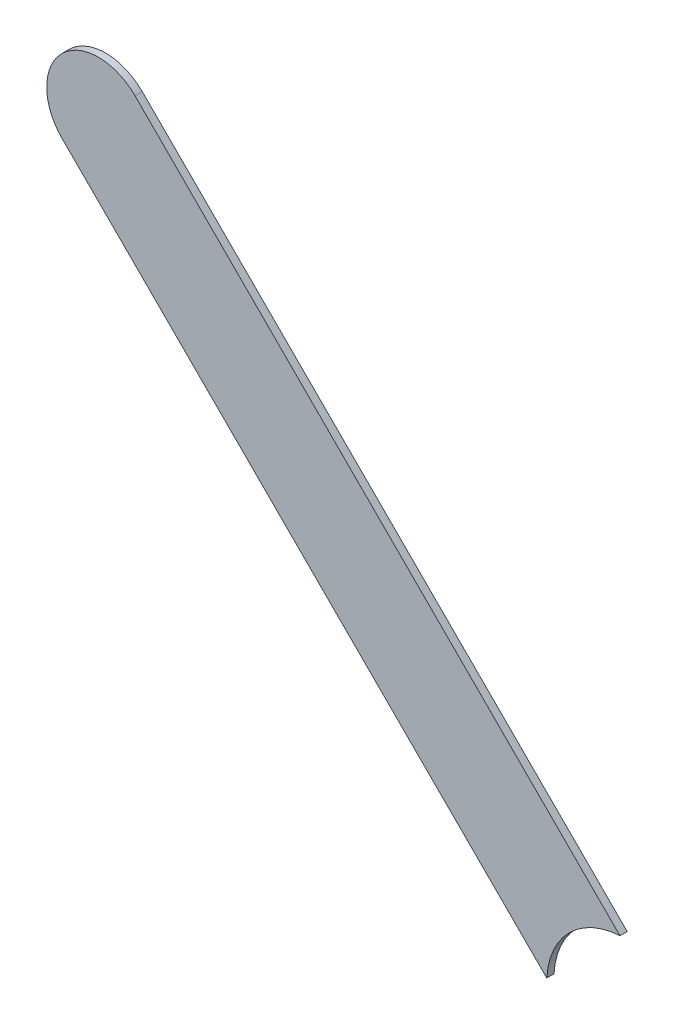
ISO-10303-21;
HEADER;
FILE_DESCRIPTION(('STEP AP214'),'2;1');
FILE_NAME('part.step','',(''),(''),'','','');
FILE_SCHEMA(('AUTOMOTIVE_DESIGN { 1 0 10303 214 1 1 1 1 }'));
ENDSEC;
DATA;
#1=APPLICATION_CONTEXT('core data for automotive mechanical design processes');
#2=APPLICATION_PROTOCOL_DEFINITION('international standard','automotive_design',2000,#1);
#3=PRODUCT_CONTEXT('',#1,'mechanical');
#4=PRODUCT('Part','Part','',(#3));
#5=PRODUCT_RELATED_PRODUCT_CATEGORY('part','',(#4));
#6=PRODUCT_DEFINITION_FORMATION('','',#4);
#7=PRODUCT_DEFINITION_CONTEXT('part definition',#1,'design');
#8=PRODUCT_DEFINITION('design','',#6,#7);
#9=PRODUCT_DEFINITION_SHAPE('','',#8);
#10=(LENGTH_UNIT() NAMED_UNIT(*) SI_UNIT(.MILLI.,.METRE.));
#11=(NAMED_UNIT(*) PLANE_ANGLE_UNIT() SI_UNIT($,.RADIAN.));
#12=(NAMED_UNIT(*) SI_UNIT($,.STERADIAN.) SOLID_ANGLE_UNIT());
#13=UNCERTAINTY_MEASURE_WITH_UNIT(LENGTH_MEASURE(1.E-05),#10,'distance_accuracy_value','');
#14=(GEOMETRIC_REPRESENTATION_CONTEXT(3) GLOBAL_UNCERTAINTY_ASSIGNED_CONTEXT((#13)) GLOBAL_UNIT_ASSIGNED_CONTEXT((#10,
#11,#12)) REPRESENTATION_CONTEXT('',''));
#15=CARTESIAN_POINT('',(0.,0.,0.));
#16=DIRECTION('',(0.,0.,1.));
#17=DIRECTION('',(1.,0.,0.));
#18=AXIS2_PLACEMENT_3D('',#15,#16,#17);
#19=CARTESIAN_POINT('',(170.483776,-133.300223,-0.035));
#20=DIRECTION('',(-0.707106781186548,-0.707106781186548,0.));
#21=DIRECTION('',(-0.707106781186548,0.707106781186548,0.));
#22=AXIS2_PLACEMENT_3D('',#19,#20,#21);
#23=PLANE('',#22);
#24=DIRECTION('',(0.,0.,1.));
#25=VECTOR('',#24,1.);
#26=CARTESIAN_POINT('',(167.943776,-130.760223,-0.035));
#27=LINE('',#26,#25);
#28=CARTESIAN_POINT('',(167.943776,-130.760223,-0.035));
#29=VERTEX_POINT('',#28);
#30=CARTESIAN_POINT('',(167.943776,-130.760223,0.));
#31=VERTEX_POINT('',#30);
#32=EDGE_CURVE('E11',#29,#31,#27,.T.);
#33=ORIENTED_EDGE('',*,*,#32,.T.);
#34=DIRECTION('',(-0.707106781186548,0.707106781186548,0.));
#35=VECTOR('',#34,1.);
#36=CARTESIAN_POINT('',(170.483776,-133.300223,0.));
#37=LINE('',#36,#35);
#38=CARTESIAN_POINT('',(170.28613397155,-133.1025809715,0.));
#39=VERTEX_POINT('',#38);
#40=EDGE_CURVE('E20',#39,#31,#37,.T.);
#41=ORIENTED_EDGE('',*,*,#40,.F.);
#42=DIRECTION('',(0.,0.,-1.));
#43=VECTOR('',#42,1.);
#44=CARTESIAN_POINT('',(170.28613397156,-133.1025809715,-0.045));
#45=LINE('',#44,#43);
#46=CARTESIAN_POINT('',(170.28613397155,-133.1025809715,-0.035));
#47=VERTEX_POINT('',#46);
#48=EDGE_CURVE('E73',#39,#47,#45,.T.);
#49=ORIENTED_EDGE('',*,*,#48,.T.);
#50=DIRECTION('',(-0.707106781186548,0.707106781186548,0.));
#51=VECTOR('',#50,1.);
#52=CARTESIAN_POINT('',(170.483776,-133.300223,-0.035));
#53=LINE('',#52,#51);
#54=EDGE_CURVE('E104',#47,#29,#53,.T.);
#55=ORIENTED_EDGE('',*,*,#54,.T.);
#56=EDGE_LOOP('',(#33,#41,#49,#55));
#57=FACE_BOUND('',#56,.T.);
#58=ADVANCED_FACE('F17',(#57),#23,.F.);
#59=CARTESIAN_POINT('',(167.7669995,-130.9369995,-0.035));
#60=DIRECTION('',(0.,0.,-1.));
#61=DIRECTION('',(0.707106781186548,0.707106781186548,0.));
#62=AXIS2_PLACEMENT_3D('',#59,#60,#61);
#63=CYLINDRICAL_SURFACE('',#62,0.249999723809);
#64=CARTESIAN_POINT('',(167.7669995,-130.9369995,-0.035));
#65=DIRECTION('',(0.,0.,1.));
#66=DIRECTION('',(0.707106781186548,0.707106781186548,0.));
#67=AXIS2_PLACEMENT_3D('',#64,#65,#66);
#68=CIRCLE('',#67,0.249999723809);
#69=CARTESIAN_POINT('',(167.590223,-131.113776,-0.035));
#70=VERTEX_POINT('',#69);
#71=EDGE_CURVE('E76',#29,#70,#68,.T.);
#72=ORIENTED_EDGE('',*,*,#71,.T.);
#73=DIRECTION('',(0.,0.,1.));
#74=VECTOR('',#73,1.);
#75=CARTESIAN_POINT('',(167.590223,-131.113776,-0.035));
#76=LINE('',#75,#74);
#77=CARTESIAN_POINT('',(167.590223,-131.113776,0.));
#78=VERTEX_POINT('',#77);
#79=EDGE_CURVE('E86',#70,#78,#76,.T.);
#80=ORIENTED_EDGE('',*,*,#79,.T.);
#81=CARTESIAN_POINT('',(167.7669995,-130.9369995,0.));
#82=DIRECTION('',(0.,0.,1.));
#83=DIRECTION('',(0.707106781186548,0.707106781186548,0.));
#84=AXIS2_PLACEMENT_3D('',#81,#82,#83);
#85=CIRCLE('',#84,0.249999723809);
#86=EDGE_CURVE('E81',#31,#78,#85,.T.);
#87=ORIENTED_EDGE('',*,*,#86,.F.);
#88=ORIENTED_EDGE('',*,*,#32,.F.);
#89=EDGE_LOOP('',(#72,#80,#87,#88));
#90=FACE_BOUND('',#89,.T.);
#91=ADVANCED_FACE('F165',(#90),#63,.T.);
#92=CARTESIAN_POINT('',(167.590223,-131.113776,0.));
#93=DIRECTION('',(0.,0.,1.));
#94=DIRECTION('',(1.,0.,0.));
#95=AXIS2_PLACEMENT_3D('',#92,#93,#94);
#96=PLANE('',#95);
#97=ORIENTED_EDGE('',*,*,#86,.T.);
#98=DIRECTION('',(0.707106781186548,-0.707106781186548,0.));
#99=VECTOR('',#98,1.);
#100=CARTESIAN_POINT('',(167.590223,-131.113776,0.));
#101=LINE('',#100,#99);
#102=CARTESIAN_POINT('',(169.93258097157,-133.4561339715,0.));
#103=VERTEX_POINT('',#102);
#104=EDGE_CURVE('E78',#78,#103,#101,.T.);
#105=ORIENTED_EDGE('',*,*,#104,.T.);
#106=CARTESIAN_POINT('',(170.307,-133.477,0.));
#107=DIRECTION('',(0.,0.,-1.));
#108=DIRECTION('',(0.,-1.,0.));
#109=AXIS2_PLACEMENT_3D('',#106,#107,#108);
#110=CIRCLE('',#109,0.375);
#111=EDGE_CURVE('E67',#103,#39,#110,.T.);
#112=ORIENTED_EDGE('',*,*,#111,.T.);
#113=ORIENTED_EDGE('',*,*,#40,.T.);
#114=EDGE_LOOP('',(#97,#105,#112,#113));
#115=FACE_BOUND('',#114,.T.);
#116=ADVANCED_FACE('F79',(#115),#96,.T.);
#117=CARTESIAN_POINT('',(170.307,-133.477,-0.045));
#118=DIRECTION('',(0.,0.,-1.));
#119=DIRECTION('',(0.,-1.,0.));
#120=AXIS2_PLACEMENT_3D('',#117,#118,#119);
#121=CYLINDRICAL_SURFACE('',#120,0.375);
#122=ORIENTED_EDGE('',*,*,#111,.F.);
#123=DIRECTION('',(0.,0.,-1.));
#124=VECTOR('',#123,1.);
#125=CARTESIAN_POINT('',(169.93258097156,-133.4561339715,-0.045));
#126=LINE('',#125,#124);
#127=CARTESIAN_POINT('',(169.93258097157,-133.4561339715,-0.035));
#128=VERTEX_POINT('',#127);
#129=EDGE_CURVE('E72',#103,#128,#126,.T.);
#130=ORIENTED_EDGE('',*,*,#129,.T.);
#131=CARTESIAN_POINT('',(170.307,-133.477,-0.035));
#132=DIRECTION('',(0.,0.,-1.));
#133=DIRECTION('',(0.,-1.,0.));
#134=AXIS2_PLACEMENT_3D('',#131,#132,#133);
#135=CIRCLE('',#134,0.375);
#136=EDGE_CURVE('E98',#128,#47,#135,.T.);
#137=ORIENTED_EDGE('',*,*,#136,.T.);
#138=ORIENTED_EDGE('',*,*,#48,.F.);
#139=EDGE_LOOP('',(#122,#130,#137,#138));
#140=FACE_BOUND('',#139,.T.);
#141=ADVANCED_FACE('F69',(#140),#121,.F.);
#142=CARTESIAN_POINT('',(167.590223,-131.113776,-0.035));
#143=DIRECTION('',(0.,0.,1.));
#144=DIRECTION('',(1.,0.,0.));
#145=AXIS2_PLACEMENT_3D('',#142,#143,#144);
#146=PLANE('',#145);
#147=ORIENTED_EDGE('',*,*,#54,.F.);
#148=ORIENTED_EDGE('',*,*,#136,.F.);
#149=DIRECTION('',(0.707106781186548,-0.707106781186548,0.));
#150=VECTOR('',#149,1.);
#151=CARTESIAN_POINT('',(167.590223,-131.113776,-0.035));
#152=LINE('',#151,#150);
#153=EDGE_CURVE('E91',#70,#128,#152,.T.);
#154=ORIENTED_EDGE('',*,*,#153,.F.);
#155=ORIENTED_EDGE('',*,*,#71,.F.);
#156=EDGE_LOOP('',(#147,#148,#154,#155));
#157=FACE_BOUND('',#156,.T.);
#158=ADVANCED_FACE('F120',(#157),#146,.F.);
#159=CARTESIAN_POINT('',(167.590223,-131.113776,-0.035));
#160=DIRECTION('',(0.707106781186548,0.707106781186548,0.));
#161=DIRECTION('',(0.,0.,-1.));
#162=AXIS2_PLACEMENT_3D('',#159,#160,#161);
#163=PLANE('',#162);
#164=ORIENTED_EDGE('',*,*,#129,.F.);
#165=ORIENTED_EDGE('',*,*,#104,.F.);
#166=ORIENTED_EDGE('',*,*,#79,.F.);
#167=ORIENTED_EDGE('',*,*,#153,.T.);
#168=EDGE_LOOP('',(#164,#165,#166,#167));
#169=FACE_BOUND('',#168,.T.);
#170=ADVANCED_FACE('F89',(#169),#163,.F.);
#171=CLOSED_SHELL('',(#58,#91,#116,#141,#158,#170));
#172=MANIFOLD_SOLID_BREP('B1',#171);
#173=ADVANCED_BREP_SHAPE_REPRESENTATION('',(#18,#172),#14);
#174=SHAPE_DEFINITION_REPRESENTATION(#9,#173);
ENDSEC;
END-ISO-10303-21;
